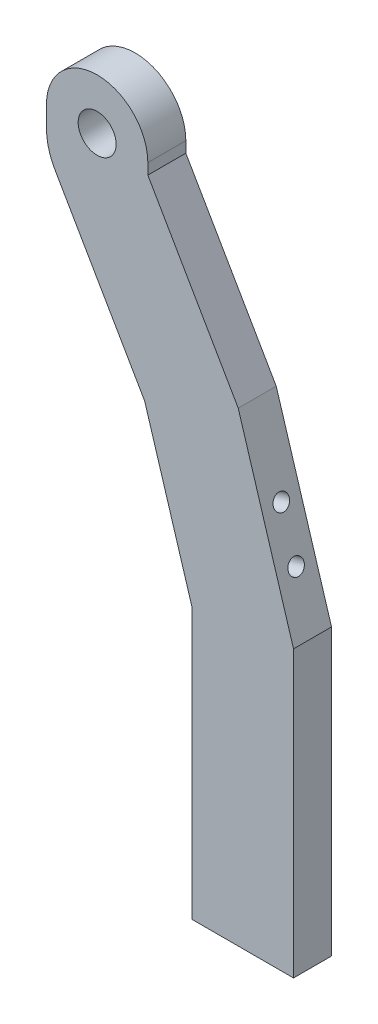
ISO-10303-21;
HEADER;
FILE_DESCRIPTION(('STEP AP214'),'2;1');
FILE_NAME('part.step','',(''),(''),'','','');
FILE_SCHEMA(('AUTOMOTIVE_DESIGN { 1 0 10303 214 1 1 1 1 }'));
ENDSEC;
DATA;
#1=APPLICATION_CONTEXT('core data for automotive mechanical design processes');
#2=APPLICATION_PROTOCOL_DEFINITION('international standard','automotive_design',2000,#1);
#3=PRODUCT_CONTEXT('',#1,'mechanical');
#4=PRODUCT('Part','Part','',(#3));
#5=PRODUCT_RELATED_PRODUCT_CATEGORY('part','',(#4));
#6=PRODUCT_DEFINITION_FORMATION('','',#4);
#7=PRODUCT_DEFINITION_CONTEXT('part definition',#1,'design');
#8=PRODUCT_DEFINITION('design','',#6,#7);
#9=PRODUCT_DEFINITION_SHAPE('','',#8);
#10=(LENGTH_UNIT() NAMED_UNIT(*) SI_UNIT(.MILLI.,.METRE.));
#11=(NAMED_UNIT(*) PLANE_ANGLE_UNIT() SI_UNIT($,.RADIAN.));
#12=(NAMED_UNIT(*) SI_UNIT($,.STERADIAN.) SOLID_ANGLE_UNIT());
#13=UNCERTAINTY_MEASURE_WITH_UNIT(LENGTH_MEASURE(1.E-05),#10,'distance_accuracy_value','');
#14=(GEOMETRIC_REPRESENTATION_CONTEXT(3) GLOBAL_UNCERTAINTY_ASSIGNED_CONTEXT((#13)) GLOBAL_UNIT_ASSIGNED_CONTEXT((#10,
#11,#12)) REPRESENTATION_CONTEXT('',''));
#15=CARTESIAN_POINT('',(0.,0.,0.));
#16=DIRECTION('',(0.,0.,1.));
#17=DIRECTION('',(1.,0.,0.));
#18=AXIS2_PLACEMENT_3D('',#15,#16,#17);
#19=CARTESIAN_POINT('',(-11.8327005271482,49.4894318474889,0.));
#20=DIRECTION('',(0.,0.,1.));
#21=DIRECTION('',(1.,0.,0.));
#22=AXIS2_PLACEMENT_3D('',#19,#20,#21);
#23=PLANE('',#22);
#24=CARTESIAN_POINT('',(-11.8327005271482,49.4894318474889,0.));
#25=DIRECTION('',(0.,0.,1.));
#26=DIRECTION('',(1.,0.,0.));
#27=AXIS2_PLACEMENT_3D('',#24,#25,#26);
#28=CIRCLE('',#27,3.00000000000001);
#29=CARTESIAN_POINT('',(-8.83270052714822,49.4894318474889,0.));
#30=VERTEX_POINT('',#29);
#31=EDGE_CURVE('E203',#30,#30,#28,.T.);
#32=ORIENTED_EDGE('',*,*,#31,.T.);
#33=EDGE_LOOP('',(#32));
#34=FACE_BOUND('',#33,.T.);
#35=DIRECTION('',(-0.499999999999996,0.866025403784441,0.));
#36=VECTOR('',#35,1.);
#37=CARTESIAN_POINT('',(19.1672994728518,7.93945035230217,0.));
#38=LINE('',#37,#36);
#39=CARTESIAN_POINT('',(10.4392225216315,23.0569230841868,0.));
#40=VERTEX_POINT('',#39);
#41=CARTESIAN_POINT('',(-3.83270052714824,47.7766189263868,0.));
#42=VERTEX_POINT('',#41);
#43=EDGE_CURVE('E234',#40,#42,#38,.T.);
#44=ORIENTED_EDGE('',*,*,#43,.F.);
#45=DIRECTION('',(0.292371704722731,-0.956304755963037,0.));
#46=VECTOR('',#45,1.);
#47=CARTESIAN_POINT('',(10.4392225216314,23.0569230841868,0.));
#48=LINE('',#47,#46);
#49=CARTESIAN_POINT('',(19.1672994728518,-5.4913302660442,0.));
#50=VERTEX_POINT('',#49);
#51=EDGE_CURVE('E165',#40,#50,#48,.T.);
#52=ORIENTED_EDGE('',*,*,#51,.T.);
#53=DIRECTION('',(0.,1.,0.));
#54=VECTOR('',#53,1.);
#55=CARTESIAN_POINT('',(19.1672994728518,-56.4913302660442,0.));
#56=LINE('',#55,#54);
#57=CARTESIAN_POINT('',(19.1672994728518,-50.4913302660442,0.));
#58=VERTEX_POINT('',#57);
#59=EDGE_CURVE('E207',#58,#50,#56,.T.);
#60=ORIENTED_EDGE('',*,*,#59,.F.);
#61=DIRECTION('',(1.,0.,0.));
#62=VECTOR('',#61,1.);
#63=CARTESIAN_POINT('',(-11.8327005271482,-50.4913302660442,0.));
#64=LINE('',#63,#62);
#65=CARTESIAN_POINT('',(3.16729947285174,-50.4913302660442,0.));
#66=VERTEX_POINT('',#65);
#67=EDGE_CURVE('E200',#66,#58,#64,.T.);
#68=ORIENTED_EDGE('',*,*,#67,.F.);
#69=DIRECTION('',(0.,-1.,0.));
#70=VECTOR('',#69,1.);
#71=CARTESIAN_POINT('',(3.16729947285175,3.65226327340427,0.));
#72=LINE('',#71,#70);
#73=CARTESIAN_POINT('',(3.16729947285175,-7.88254628763014,0.));
#74=VERTEX_POINT('',#73);
#75=EDGE_CURVE('E215',#74,#66,#72,.T.);
#76=ORIENTED_EDGE('',*,*,#75,.F.);
#77=DIRECTION('',(-0.292371704722731,0.956304755963037,0.));
#78=VECTOR('',#77,1.);
#79=CARTESIAN_POINT('',(-4.32866880533318,16.6356611831456,0.));
#80=LINE('',#79,#78);
#81=CARTESIAN_POINT('',(-4.32866880533337,16.6356611831456,0.));
#82=VERTEX_POINT('',#81);
#83=EDGE_CURVE('E161',#74,#82,#80,.T.);
#84=ORIENTED_EDGE('',*,*,#83,.T.);
#85=DIRECTION('',(0.499999999999995,-0.866025403784441,0.));
#86=VECTOR('',#85,1.);
#87=CARTESIAN_POINT('',(-19.8327005271482,43.4894318474889,0.));
#88=LINE('',#87,#86);
#89=CARTESIAN_POINT('',(-18.4929545649926,41.1689237718002,0.));
#90=VERTEX_POINT('',#89);
#91=EDGE_CURVE('E55',#90,#82,#88,.T.);
#92=ORIENTED_EDGE('',*,*,#91,.F.);
#93=CARTESIAN_POINT('',(-9.83270052714823,46.1689237718001,0.));
#94=DIRECTION('',(0.,0.,1.));
#95=DIRECTION('',(1.,0.,0.));
#96=AXIS2_PLACEMENT_3D('',#93,#94,#95);
#97=CIRCLE('',#96,10.);
#98=CARTESIAN_POINT('',(-19.8327005271482,46.1689237718001,0.));
#99=VERTEX_POINT('',#98);
#100=EDGE_CURVE('E257',#90,#99,#97,.F.);
#101=ORIENTED_EDGE('',*,*,#100,.T.);
#102=DIRECTION('',(0.,-1.,0.));
#103=VECTOR('',#102,1.);
#104=CARTESIAN_POINT('',(-19.8327005271482,49.4894318474889,0.));
#105=LINE('',#104,#103);
#106=CARTESIAN_POINT('',(-19.8327005271482,49.4894318474889,0.));
#107=VERTEX_POINT('',#106);
#108=EDGE_CURVE('E240',#107,#99,#105,.T.);
#109=ORIENTED_EDGE('',*,*,#108,.F.);
#110=CARTESIAN_POINT('',(-11.8327005271482,49.4894318474889,0.));
#111=DIRECTION('',(0.,0.,1.));
#112=DIRECTION('',(1.,0.,0.));
#113=AXIS2_PLACEMENT_3D('',#110,#111,#112);
#114=CIRCLE('',#113,8.);
#115=CARTESIAN_POINT('',(-3.83270052714823,49.4894318474889,0.));
#116=VERTEX_POINT('',#115);
#117=EDGE_CURVE('E238',#116,#107,#114,.T.);
#118=ORIENTED_EDGE('',*,*,#117,.F.);
#119=DIRECTION('',(0.,1.,0.));
#120=VECTOR('',#119,1.);
#121=CARTESIAN_POINT('',(-3.83270052714824,47.7766189263868,0.));
#122=LINE('',#121,#120);
#123=EDGE_CURVE('E236',#42,#116,#122,.T.);
#124=ORIENTED_EDGE('',*,*,#123,.F.);
#125=EDGE_LOOP('',(#44,#52,#60,#68,#76,#84,#92,#101,#109,#118,#124));
#126=FACE_BOUND('',#125,.T.);
#127=ADVANCED_FACE('F40',(#34,#126),#23,.F.);
#128=CARTESIAN_POINT('',(-11.8327005271482,49.4894318474889,6.));
#129=DIRECTION('',(0.,0.,1.));
#130=DIRECTION('',(1.,0.,0.));
#131=AXIS2_PLACEMENT_3D('',#128,#129,#130);
#132=PLANE('',#131);
#133=DIRECTION('',(0.499999999999995,-0.866025403784441,0.));
#134=VECTOR('',#133,1.);
#135=CARTESIAN_POINT('',(-19.8327005271482,43.4894318474889,6.));
#136=LINE('',#135,#134);
#137=CARTESIAN_POINT('',(-18.4929545649926,41.1689237718002,6.));
#138=VERTEX_POINT('',#137);
#139=CARTESIAN_POINT('',(-4.32866880533337,16.6356611831456,6.));
#140=VERTEX_POINT('',#139);
#141=EDGE_CURVE('E225',#138,#140,#136,.T.);
#142=ORIENTED_EDGE('',*,*,#141,.T.);
#143=DIRECTION('',(0.292371704722731,-0.956304755963037,0.));
#144=VECTOR('',#143,1.);
#145=CARTESIAN_POINT('',(-4.32866880533318,16.6356611831456,6.));
#146=LINE('',#145,#144);
#147=CARTESIAN_POINT('',(3.16729947285175,-7.88254628763014,6.));
#148=VERTEX_POINT('',#147);
#149=EDGE_CURVE('E154',#140,#148,#146,.T.);
#150=ORIENTED_EDGE('',*,*,#149,.T.);
#151=DIRECTION('',(0.,-1.,0.));
#152=VECTOR('',#151,1.);
#153=CARTESIAN_POINT('',(3.16729947285175,3.65226327340427,6.));
#154=LINE('',#153,#152);
#155=CARTESIAN_POINT('',(3.16729947285175,-50.4913302660442,6.));
#156=VERTEX_POINT('',#155);
#157=EDGE_CURVE('E227',#148,#156,#154,.T.);
#158=ORIENTED_EDGE('',*,*,#157,.T.);
#159=DIRECTION('',(-1.,0.,0.));
#160=VECTOR('',#159,1.);
#161=CARTESIAN_POINT('',(-11.8327005271482,-50.4913302660442,6.));
#162=LINE('',#161,#160);
#163=CARTESIAN_POINT('',(19.1672994728518,-50.4913302660442,6.));
#164=VERTEX_POINT('',#163);
#165=EDGE_CURVE('E195',#164,#156,#162,.T.);
#166=ORIENTED_EDGE('',*,*,#165,.F.);
#167=DIRECTION('',(0.,1.,0.));
#168=VECTOR('',#167,1.);
#169=CARTESIAN_POINT('',(19.1672994728518,-56.4913302660442,6.));
#170=LINE('',#169,#168);
#171=CARTESIAN_POINT('',(19.1672994728518,-5.4913302660442,6.));
#172=VERTEX_POINT('',#171);
#173=EDGE_CURVE('E210',#164,#172,#170,.T.);
#174=ORIENTED_EDGE('',*,*,#173,.T.);
#175=DIRECTION('',(0.292371704722731,-0.956304755963037,0.));
#176=VECTOR('',#175,1.);
#177=CARTESIAN_POINT('',(10.4392225216314,23.0569230841868,6.));
#178=LINE('',#177,#176);
#179=CARTESIAN_POINT('',(10.4392225216314,23.0569230841868,6.));
#180=VERTEX_POINT('',#179);
#181=EDGE_CURVE('E164',#180,#172,#178,.T.);
#182=ORIENTED_EDGE('',*,*,#181,.F.);
#183=DIRECTION('',(-0.499999999999996,0.866025403784441,0.));
#184=VECTOR('',#183,1.);
#185=CARTESIAN_POINT('',(19.1672994728518,7.93945035230217,6.));
#186=LINE('',#185,#184);
#187=CARTESIAN_POINT('',(-3.83270052714824,47.7766189263868,6.));
#188=VERTEX_POINT('',#187);
#189=EDGE_CURVE('E214',#180,#188,#186,.T.);
#190=ORIENTED_EDGE('',*,*,#189,.T.);
#191=DIRECTION('',(0.,1.,0.));
#192=VECTOR('',#191,1.);
#193=CARTESIAN_POINT('',(-3.83270052714824,47.7766189263868,6.));
#194=LINE('',#193,#192);
#195=CARTESIAN_POINT('',(-3.83270052714823,49.4894318474889,6.));
#196=VERTEX_POINT('',#195);
#197=EDGE_CURVE('E218',#188,#196,#194,.T.);
#198=ORIENTED_EDGE('',*,*,#197,.T.);
#199=CARTESIAN_POINT('',(-11.8327005271482,49.4894318474889,6.));
#200=DIRECTION('',(0.,0.,1.));
#201=DIRECTION('',(1.,0.,0.));
#202=AXIS2_PLACEMENT_3D('',#199,#200,#201);
#203=CIRCLE('',#202,8.);
#204=CARTESIAN_POINT('',(-19.8327005271482,49.4894318474889,6.));
#205=VERTEX_POINT('',#204);
#206=EDGE_CURVE('E220',#196,#205,#203,.T.);
#207=ORIENTED_EDGE('',*,*,#206,.T.);
#208=DIRECTION('',(0.,-1.,0.));
#209=VECTOR('',#208,1.);
#210=CARTESIAN_POINT('',(-19.8327005271482,49.4894318474889,6.));
#211=LINE('',#210,#209);
#212=CARTESIAN_POINT('',(-19.8327005271482,46.1689237718001,6.));
#213=VERTEX_POINT('',#212);
#214=EDGE_CURVE('E222',#205,#213,#211,.T.);
#215=ORIENTED_EDGE('',*,*,#214,.T.);
#216=CARTESIAN_POINT('',(-9.83270052714823,46.1689237718001,6.));
#217=DIRECTION('',(0.,0.,1.));
#218=DIRECTION('',(1.,0.,0.));
#219=AXIS2_PLACEMENT_3D('',#216,#217,#218);
#220=CIRCLE('',#219,10.);
#221=EDGE_CURVE('E11',#213,#138,#220,.T.);
#222=ORIENTED_EDGE('',*,*,#221,.T.);
#223=EDGE_LOOP('',(#142,#150,#158,#166,#174,#182,#190,#198,#207,#215,#222));
#224=FACE_BOUND('',#223,.T.);
#225=CARTESIAN_POINT('',(-11.8327005271482,49.4894318474889,6.));
#226=DIRECTION('',(0.,0.,1.));
#227=DIRECTION('',(1.,0.,0.));
#228=AXIS2_PLACEMENT_3D('',#225,#226,#227);
#229=CIRCLE('',#228,3.00000000000001);
#230=CARTESIAN_POINT('',(-8.83270052714822,49.4894318474889,6.));
#231=VERTEX_POINT('',#230);
#232=EDGE_CURVE('E204',#231,#231,#229,.T.);
#233=ORIENTED_EDGE('',*,*,#232,.F.);
#234=EDGE_LOOP('',(#233));
#235=FACE_BOUND('',#234,.T.);
#236=ADVANCED_FACE('F266',(#224,#235),#132,.T.);
#237=CARTESIAN_POINT('',(19.1672994728518,-56.4913302660442,6.));
#238=DIRECTION('',(-1.,0.,0.));
#239=DIRECTION('',(0.,0.,1.));
#240=AXIS2_PLACEMENT_3D('',#237,#238,#239);
#241=PLANE('',#240);
#242=ORIENTED_EDGE('',*,*,#59,.T.);
#243=DIRECTION('',(0.,0.,1.));
#244=VECTOR('',#243,1.);
#245=CARTESIAN_POINT('',(19.1672994728518,-5.4913302660442,0.));
#246=LINE('',#245,#244);
#247=EDGE_CURVE('E168',#50,#172,#246,.T.);
#248=ORIENTED_EDGE('',*,*,#247,.T.);
#249=ORIENTED_EDGE('',*,*,#173,.F.);
#250=DIRECTION('',(0.,0.,1.));
#251=VECTOR('',#250,1.);
#252=CARTESIAN_POINT('',(19.1672994728518,-50.4913302660442,11.8195488073355));
#253=LINE('',#252,#251);
#254=EDGE_CURVE('E190',#58,#164,#253,.T.);
#255=ORIENTED_EDGE('',*,*,#254,.F.);
#256=EDGE_LOOP('',(#242,#248,#249,#255));
#257=FACE_BOUND('',#256,.T.);
#258=ADVANCED_FACE('F304',(#257),#241,.F.);
#259=CARTESIAN_POINT('',(19.1672994728518,7.93945035230217,6.));
#260=DIRECTION('',(-0.866025403784441,-0.499999999999996,0.));
#261=DIRECTION('',(0.499999999999996,-0.866025403784441,0.));
#262=AXIS2_PLACEMENT_3D('',#259,#260,#261);
#263=PLANE('',#262);
#264=ORIENTED_EDGE('',*,*,#189,.F.);
#265=DIRECTION('',(0.,0.,1.));
#266=VECTOR('',#265,1.);
#267=CARTESIAN_POINT('',(10.4392225216314,23.0569230841868,0.));
#268=LINE('',#267,#266);
#269=EDGE_CURVE('E170',#40,#180,#268,.T.);
#270=ORIENTED_EDGE('',*,*,#269,.F.);
#271=ORIENTED_EDGE('',*,*,#43,.T.);
#272=DIRECTION('',(0.,0.,-1.));
#273=VECTOR('',#272,1.);
#274=CARTESIAN_POINT('',(-3.83270052714824,47.7766189263868,6.));
#275=LINE('',#274,#273);
#276=EDGE_CURVE('E252',#188,#42,#275,.T.);
#277=ORIENTED_EDGE('',*,*,#276,.F.);
#278=EDGE_LOOP('',(#264,#270,#271,#277));
#279=FACE_BOUND('',#278,.T.);
#280=ADVANCED_FACE('F354',(#279),#263,.F.);
#281=CARTESIAN_POINT('',(-3.83270052714824,47.7766189263868,6.));
#282=DIRECTION('',(-1.,0.,0.));
#283=DIRECTION('',(0.,-1.,0.));
#284=AXIS2_PLACEMENT_3D('',#281,#282,#283);
#285=PLANE('',#284);
#286=ORIENTED_EDGE('',*,*,#123,.T.);
#287=DIRECTION('',(0.,0.,-1.));
#288=VECTOR('',#287,1.);
#289=CARTESIAN_POINT('',(-3.83270052714823,49.4894318474889,6.));
#290=LINE('',#289,#288);
#291=EDGE_CURVE('E249',#196,#116,#290,.T.);
#292=ORIENTED_EDGE('',*,*,#291,.F.);
#293=ORIENTED_EDGE('',*,*,#197,.F.);
#294=ORIENTED_EDGE('',*,*,#276,.T.);
#295=EDGE_LOOP('',(#286,#292,#293,#294));
#296=FACE_BOUND('',#295,.T.);
#297=ADVANCED_FACE('F359',(#296),#285,.F.);
#298=CARTESIAN_POINT('',(-11.8327005271482,49.4894318474889,6.));
#299=DIRECTION('',(0.,0.,-1.));
#300=DIRECTION('',(-1.,0.,0.));
#301=AXIS2_PLACEMENT_3D('',#298,#299,#300);
#302=CYLINDRICAL_SURFACE('',#301,8.);
#303=ORIENTED_EDGE('',*,*,#117,.T.);
#304=DIRECTION('',(0.,0.,-1.));
#305=VECTOR('',#304,1.);
#306=CARTESIAN_POINT('',(-19.8327005271482,49.4894318474889,6.));
#307=LINE('',#306,#305);
#308=EDGE_CURVE('E230',#205,#107,#307,.T.);
#309=ORIENTED_EDGE('',*,*,#308,.F.);
#310=ORIENTED_EDGE('',*,*,#206,.F.);
#311=ORIENTED_EDGE('',*,*,#291,.T.);
#312=EDGE_LOOP('',(#303,#309,#310,#311));
#313=FACE_BOUND('',#312,.T.);
#314=ADVANCED_FACE('F362',(#313),#302,.T.);
#315=CARTESIAN_POINT('',(-19.8327005271482,49.4894318474889,6.));
#316=DIRECTION('',(1.,0.,0.));
#317=DIRECTION('',(0.,1.,0.));
#318=AXIS2_PLACEMENT_3D('',#315,#316,#317);
#319=PLANE('',#318);
#320=ORIENTED_EDGE('',*,*,#108,.T.);
#321=DIRECTION('',(0.,0.,-1.));
#322=VECTOR('',#321,1.);
#323=CARTESIAN_POINT('',(-19.8327005271482,46.1689237718001,6.));
#324=LINE('',#323,#322);
#325=EDGE_CURVE('E48',#99,#213,#324,.F.);
#326=ORIENTED_EDGE('',*,*,#325,.T.);
#327=ORIENTED_EDGE('',*,*,#214,.F.);
#328=ORIENTED_EDGE('',*,*,#308,.T.);
#329=EDGE_LOOP('',(#320,#326,#327,#328));
#330=FACE_BOUND('',#329,.T.);
#331=ADVANCED_FACE('F261',(#330),#319,.F.);
#332=CARTESIAN_POINT('',(-19.8327005271482,43.4894318474889,6.));
#333=DIRECTION('',(0.866025403784441,0.499999999999995,0.));
#334=DIRECTION('',(-0.499999999999995,0.866025403784441,0.));
#335=AXIS2_PLACEMENT_3D('',#332,#333,#334);
#336=PLANE('',#335);
#337=ORIENTED_EDGE('',*,*,#91,.T.);
#338=DIRECTION('',(0.,0.,1.));
#339=VECTOR('',#338,1.);
#340=CARTESIAN_POINT('',(-4.32866880533318,16.6356611831456,-25.6384874360318));
#341=LINE('',#340,#339);
#342=EDGE_CURVE('E60',#82,#140,#341,.T.);
#343=ORIENTED_EDGE('',*,*,#342,.T.);
#344=ORIENTED_EDGE('',*,*,#141,.F.);
#345=DIRECTION('',(0.,0.,-1.));
#346=VECTOR('',#345,1.);
#347=CARTESIAN_POINT('',(-18.4929545649926,41.1689237718002,6.));
#348=LINE('',#347,#346);
#349=EDGE_CURVE('E255',#138,#90,#348,.T.);
#350=ORIENTED_EDGE('',*,*,#349,.T.);
#351=EDGE_LOOP('',(#337,#343,#344,#350));
#352=FACE_BOUND('',#351,.T.);
#353=ADVANCED_FACE('F271',(#352),#336,.F.);
#354=CARTESIAN_POINT('',(3.16729947285175,3.65226327340427,6.));
#355=DIRECTION('',(1.,0.,0.));
#356=DIRECTION('',(0.,1.,0.));
#357=AXIS2_PLACEMENT_3D('',#354,#355,#356);
#358=PLANE('',#357);
#359=ORIENTED_EDGE('',*,*,#157,.F.);
#360=DIRECTION('',(0.,0.,1.));
#361=VECTOR('',#360,1.);
#362=CARTESIAN_POINT('',(3.16729947285175,-7.88254628763014,-25.6384874360318));
#363=LINE('',#362,#361);
#364=EDGE_CURVE('E158',#74,#148,#363,.T.);
#365=ORIENTED_EDGE('',*,*,#364,.F.);
#366=ORIENTED_EDGE('',*,*,#75,.T.);
#367=DIRECTION('',(0.,0.,-1.));
#368=VECTOR('',#367,1.);
#369=CARTESIAN_POINT('',(3.16729947285174,-50.4913302660442,11.8195488073355));
#370=LINE('',#369,#368);
#371=EDGE_CURVE('E191',#156,#66,#370,.T.);
#372=ORIENTED_EDGE('',*,*,#371,.F.);
#373=EDGE_LOOP('',(#359,#365,#366,#372));
#374=FACE_BOUND('',#373,.T.);
#375=ADVANCED_FACE('F287',(#374),#358,.F.);
#376=CARTESIAN_POINT('',(-11.8327005271482,49.4894318474889,6.));
#377=DIRECTION('',(0.,0.,-1.));
#378=DIRECTION('',(-1.,0.,0.));
#379=AXIS2_PLACEMENT_3D('',#376,#377,#378);
#380=CYLINDRICAL_SURFACE('',#379,3.00000000000001);
#381=ORIENTED_EDGE('',*,*,#232,.T.);
#382=EDGE_LOOP('',(#381));
#383=FACE_BOUND('',#382,.T.);
#384=ORIENTED_EDGE('',*,*,#31,.F.);
#385=EDGE_LOOP('',(#384));
#386=FACE_BOUND('',#385,.T.);
#387=ADVANCED_FACE('F289',(#383,#386),#380,.F.);
#388=CARTESIAN_POINT('',(-9.83270052714823,46.1689237718001,6.));
#389=DIRECTION('',(0.,0.,-1.));
#390=DIRECTION('',(-1.,0.,0.));
#391=AXIS2_PLACEMENT_3D('',#388,#389,#390);
#392=CYLINDRICAL_SURFACE('',#391,10.);
#393=ORIENTED_EDGE('',*,*,#221,.F.);
#394=ORIENTED_EDGE('',*,*,#325,.F.);
#395=ORIENTED_EDGE('',*,*,#100,.F.);
#396=ORIENTED_EDGE('',*,*,#349,.F.);
#397=EDGE_LOOP('',(#393,#394,#395,#396));
#398=FACE_BOUND('',#397,.T.);
#399=ADVANCED_FACE('F42',(#398),#392,.T.);
#400=CARTESIAN_POINT('',(-39.5429626365712,-50.4913302660442,11.8195488073355));
#401=DIRECTION('',(0.,1.,0.));
#402=DIRECTION('',(0.,0.,1.));
#403=AXIS2_PLACEMENT_3D('',#400,#401,#402);
#404=PLANE('',#403);
#405=CARTESIAN_POINT('',(7.66729947285175,-50.4913302660442,3.));
#406=DIRECTION('',(0.,-1.,0.));
#407=DIRECTION('',(0.,0.,-1.));
#408=AXIS2_PLACEMENT_3D('',#405,#406,#407);
#409=CIRCLE('',#408,1.24999999999999);
#410=CARTESIAN_POINT('',(7.66729947285175,-50.4913302660442,1.75000000000001));
#411=VERTEX_POINT('',#410);
#412=EDGE_CURVE('E172',#411,#411,#409,.T.);
#413=ORIENTED_EDGE('',*,*,#412,.F.);
#414=EDGE_LOOP('',(#413));
#415=FACE_BOUND('',#414,.T.);
#416=CARTESIAN_POINT('',(14.6672994728518,-50.4913302660442,3.));
#417=DIRECTION('',(0.,-1.,0.));
#418=DIRECTION('',(0.,0.,-1.));
#419=AXIS2_PLACEMENT_3D('',#416,#417,#418);
#420=CIRCLE('',#419,1.24999999999999);
#421=CARTESIAN_POINT('',(14.6672994728518,-50.4913302660442,1.75000000000001));
#422=VERTEX_POINT('',#421);
#423=EDGE_CURVE('E182',#422,#422,#420,.T.);
#424=ORIENTED_EDGE('',*,*,#423,.F.);
#425=EDGE_LOOP('',(#424));
#426=FACE_BOUND('',#425,.T.);
#427=ORIENTED_EDGE('',*,*,#254,.T.);
#428=ORIENTED_EDGE('',*,*,#165,.T.);
#429=ORIENTED_EDGE('',*,*,#371,.T.);
#430=ORIENTED_EDGE('',*,*,#67,.T.);
#431=EDGE_LOOP('',(#427,#428,#429,#430));
#432=FACE_BOUND('',#431,.T.);
#433=ADVANCED_FACE('F285',(#415,#426,#432),#404,.F.);
#434=CARTESIAN_POINT('',(14.6672994728518,-42.9913302660442,3.));
#435=DIRECTION('',(0.,-1.,0.));
#436=DIRECTION('',(0.,0.,-1.));
#437=AXIS2_PLACEMENT_3D('',#434,#435,#436);
#438=CONICAL_SURFACE('',#437,1.24999999999999,1.02974425867665);
#439=CARTESIAN_POINT('',(14.6672994728518,-42.2402544922598,3.));
#440=VERTEX_POINT('',#439);
#441=VERTEX_LOOP('',#440);
#442=FACE_BOUND('',#441,.T.);
#443=CARTESIAN_POINT('',(14.6672994728518,-42.9913302660442,3.));
#444=DIRECTION('',(0.,-1.,0.));
#445=DIRECTION('',(0.,0.,-1.));
#446=AXIS2_PLACEMENT_3D('',#443,#444,#445);
#447=CIRCLE('',#446,1.24999999999999);
#448=CARTESIAN_POINT('',(14.6672994728518,-42.9913302660442,1.75000000000001));
#449=VERTEX_POINT('',#448);
#450=EDGE_CURVE('E186',#449,#449,#447,.T.);
#451=ORIENTED_EDGE('',*,*,#450,.T.);
#452=EDGE_LOOP('',(#451));
#453=FACE_BOUND('',#452,.T.);
#454=ADVANCED_FACE('F309',(#442,#453),#438,.F.);
#455=CARTESIAN_POINT('',(14.6672994728518,-50.4913302660442,3.));
#456=DIRECTION('',(0.,-1.,0.));
#457=DIRECTION('',(0.,0.,-1.));
#458=AXIS2_PLACEMENT_3D('',#455,#456,#457);
#459=CYLINDRICAL_SURFACE('',#458,1.24999999999999);
#460=ORIENTED_EDGE('',*,*,#450,.F.);
#461=EDGE_LOOP('',(#460));
#462=FACE_BOUND('',#461,.T.);
#463=ORIENTED_EDGE('',*,*,#423,.T.);
#464=EDGE_LOOP('',(#463));
#465=FACE_BOUND('',#464,.T.);
#466=ADVANCED_FACE('F313',(#462,#465),#459,.F.);
#467=CARTESIAN_POINT('',(7.66729947285175,-42.9913302660442,3.));
#468=DIRECTION('',(0.,-1.,0.));
#469=DIRECTION('',(0.,0.,-1.));
#470=AXIS2_PLACEMENT_3D('',#467,#468,#469);
#471=CONICAL_SURFACE('',#470,1.24999999999999,1.02974425867665);
#472=CARTESIAN_POINT('',(7.66729947285175,-42.2402544922598,3.));
#473=VERTEX_POINT('',#472);
#474=VERTEX_LOOP('',#473);
#475=FACE_BOUND('',#474,.T.);
#476=CARTESIAN_POINT('',(7.66729947285175,-42.9913302660442,3.));
#477=DIRECTION('',(0.,-1.,0.));
#478=DIRECTION('',(0.,0.,-1.));
#479=AXIS2_PLACEMENT_3D('',#476,#477,#478);
#480=CIRCLE('',#479,1.24999999999999);
#481=CARTESIAN_POINT('',(7.66729947285175,-42.9913302660442,1.75000000000001));
#482=VERTEX_POINT('',#481);
#483=EDGE_CURVE('E178',#482,#482,#480,.T.);
#484=ORIENTED_EDGE('',*,*,#483,.T.);
#485=EDGE_LOOP('',(#484));
#486=FACE_BOUND('',#485,.T.);
#487=ADVANCED_FACE('F317',(#475,#486),#471,.F.);
#488=CARTESIAN_POINT('',(7.66729947285175,-50.4913302660442,3.));
#489=DIRECTION('',(0.,-1.,0.));
#490=DIRECTION('',(0.,0.,-1.));
#491=AXIS2_PLACEMENT_3D('',#488,#489,#490);
#492=CYLINDRICAL_SURFACE('',#491,1.24999999999999);
#493=ORIENTED_EDGE('',*,*,#483,.F.);
#494=EDGE_LOOP('',(#493));
#495=FACE_BOUND('',#494,.T.);
#496=ORIENTED_EDGE('',*,*,#412,.T.);
#497=EDGE_LOOP('',(#496));
#498=FACE_BOUND('',#497,.T.);
#499=ADVANCED_FACE('F321',(#495,#498),#492,.F.);
#500=CARTESIAN_POINT('',(10.4392225216314,23.0569230841868,0.));
#501=DIRECTION('',(-0.956304755963037,-0.292371704722731,0.));
#502=DIRECTION('',(0.292371704722731,-0.956304755963037,0.));
#503=AXIS2_PLACEMENT_3D('',#500,#501,#502);
#504=PLANE('',#503);
#505=CARTESIAN_POINT('',(14.2400546830269,10.6249612566673,3.));
#506=DIRECTION('',(0.956304755963037,0.292371704722731,0.));
#507=DIRECTION('',(-0.292371704722731,0.956304755963037,0.));
#508=AXIS2_PLACEMENT_3D('',#505,#506,#507);
#509=CIRCLE('',#508,1.24999999999999);
#510=CARTESIAN_POINT('',(13.8745900521235,11.820342201621,3.));
#511=VERTEX_POINT('',#510);
#512=EDGE_CURVE('E144',#511,#511,#509,.T.);
#513=ORIENTED_EDGE('',*,*,#512,.F.);
#514=EDGE_LOOP('',(#513));
#515=FACE_BOUND('',#514,.T.);
#516=CARTESIAN_POINT('',(16.5790283208087,2.97452320896296,3.));
#517=DIRECTION('',(0.956304755963037,0.292371704722731,0.));
#518=DIRECTION('',(-0.292371704722731,0.956304755963037,0.));
#519=AXIS2_PLACEMENT_3D('',#516,#517,#518);
#520=CIRCLE('',#519,1.24999999999999);
#521=CARTESIAN_POINT('',(16.2135636899053,4.16990415391675,3.));
#522=VERTEX_POINT('',#521);
#523=EDGE_CURVE('E143',#522,#522,#520,.T.);
#524=ORIENTED_EDGE('',*,*,#523,.F.);
#525=EDGE_LOOP('',(#524));
#526=FACE_BOUND('',#525,.T.);
#527=ORIENTED_EDGE('',*,*,#181,.T.);
#528=ORIENTED_EDGE('',*,*,#247,.F.);
#529=ORIENTED_EDGE('',*,*,#51,.F.);
#530=ORIENTED_EDGE('',*,*,#269,.T.);
#531=EDGE_LOOP('',(#527,#528,#529,#530));
#532=FACE_BOUND('',#531,.T.);
#533=ADVANCED_FACE('F325',(#515,#526,#532),#504,.F.);
#534=CARTESIAN_POINT('',(-4.32866880533318,16.6356611831456,-25.6384874360318));
#535=DIRECTION('',(-0.956304755963037,-0.292371704722731,0.));
#536=DIRECTION('',(0.292371704722731,-0.956304755963037,0.));
#537=AXIS2_PLACEMENT_3D('',#534,#535,#536);
#538=PLANE('',#537);
#539=ORIENTED_EDGE('',*,*,#83,.F.);
#540=ORIENTED_EDGE('',*,*,#364,.T.);
#541=ORIENTED_EDGE('',*,*,#149,.F.);
#542=ORIENTED_EDGE('',*,*,#342,.F.);
#543=EDGE_LOOP('',(#539,#540,#541,#542));
#544=FACE_BOUND('',#543,.T.);
#545=ADVANCED_FACE('F279',(#544),#538,.T.);
#546=CARTESIAN_POINT('',(9.40674265108592,0.781735423542483,3.));
#547=DIRECTION('',(0.956304755963037,0.292371704722731,0.));
#548=DIRECTION('',(-0.292371704722731,0.956304755963037,0.));
#549=AXIS2_PLACEMENT_3D('',#546,#547,#548);
#550=CONICAL_SURFACE('',#549,1.24999999999999,1.02974425867665);
#551=CARTESIAN_POINT('',(8.68848531652723,0.562142119185177,3.));
#552=VERTEX_POINT('',#551);
#553=VERTEX_LOOP('',#552);
#554=FACE_BOUND('',#553,.T.);
#555=CARTESIAN_POINT('',(9.40674265108592,0.781735423542483,3.));
#556=DIRECTION('',(0.956304755963037,0.292371704722731,0.));
#557=DIRECTION('',(-0.292371704722731,0.956304755963037,0.));
#558=AXIS2_PLACEMENT_3D('',#555,#556,#557);
#559=CIRCLE('',#558,1.24999999999999);
#560=CARTESIAN_POINT('',(9.04127802018252,1.97711636849627,3.));
#561=VERTEX_POINT('',#560);
#562=EDGE_CURVE('E147',#561,#561,#559,.T.);
#563=ORIENTED_EDGE('',*,*,#562,.T.);
#564=EDGE_LOOP('',(#563));
#565=FACE_BOUND('',#564,.T.);
#566=ADVANCED_FACE('F332',(#554,#565),#550,.F.);
#567=CARTESIAN_POINT('',(16.5790283208087,2.97452320896296,3.));
#568=DIRECTION('',(0.956304755963037,0.292371704722731,0.));
#569=DIRECTION('',(-0.292371704722731,0.956304755963037,0.));
#570=AXIS2_PLACEMENT_3D('',#567,#568,#569);
#571=CYLINDRICAL_SURFACE('',#570,1.24999999999999);
#572=ORIENTED_EDGE('',*,*,#562,.F.);
#573=EDGE_LOOP('',(#572));
#574=FACE_BOUND('',#573,.T.);
#575=ORIENTED_EDGE('',*,*,#523,.T.);
#576=EDGE_LOOP('',(#575));
#577=FACE_BOUND('',#576,.T.);
#578=ADVANCED_FACE('F137',(#574,#577),#571,.F.);
#579=CARTESIAN_POINT('',(7.06776901330409,8.43217347124679,3.));
#580=DIRECTION('',(0.956304755963037,0.292371704722731,0.));
#581=DIRECTION('',(-0.292371704722731,0.956304755963037,0.));
#582=AXIS2_PLACEMENT_3D('',#579,#580,#581);
#583=CONICAL_SURFACE('',#582,1.24999999999999,1.02974425867664);
#584=CARTESIAN_POINT('',(6.34951167874539,8.21258016688948,3.));
#585=VERTEX_POINT('',#584);
#586=VERTEX_LOOP('',#585);
#587=FACE_BOUND('',#586,.T.);
#588=CARTESIAN_POINT('',(7.06776901330409,8.43217347124679,3.));
#589=DIRECTION('',(0.956304755963037,0.292371704722731,0.));
#590=DIRECTION('',(-0.292371704722731,0.956304755963037,0.));
#591=AXIS2_PLACEMENT_3D('',#588,#589,#590);
#592=CIRCLE('',#591,1.24999999999999);
#593=CARTESIAN_POINT('',(6.70230438240068,9.62755441620057,3.));
#594=VERTEX_POINT('',#593);
#595=EDGE_CURVE('E141',#594,#594,#592,.T.);
#596=ORIENTED_EDGE('',*,*,#595,.T.);
#597=EDGE_LOOP('',(#596));
#598=FACE_BOUND('',#597,.T.);
#599=ADVANCED_FACE('F133',(#587,#598),#583,.F.);
#600=CARTESIAN_POINT('',(14.2400546830269,10.6249612566673,3.));
#601=DIRECTION('',(0.956304755963037,0.292371704722731,0.));
#602=DIRECTION('',(-0.292371704722731,0.956304755963037,0.));
#603=AXIS2_PLACEMENT_3D('',#600,#601,#602);
#604=CYLINDRICAL_SURFACE('',#603,1.24999999999999);
#605=ORIENTED_EDGE('',*,*,#595,.F.);
#606=EDGE_LOOP('',(#605));
#607=FACE_BOUND('',#606,.T.);
#608=ORIENTED_EDGE('',*,*,#512,.T.);
#609=EDGE_LOOP('',(#608));
#610=FACE_BOUND('',#609,.T.);
#611=ADVANCED_FACE('F136',(#607,#610),#604,.F.);
#612=CLOSED_SHELL('',(#127,#236,#258,#280,#297,#314,#331,#353,#375,#387,#399,#433,#454,#466,
#487,#499,#533,#545,#566,#578,#599,#611));
#613=MANIFOLD_SOLID_BREP('B2',#612);
#614=ADVANCED_BREP_SHAPE_REPRESENTATION('',(#18,#613),#14);
#615=SHAPE_DEFINITION_REPRESENTATION(#9,#614);
ENDSEC;
END-ISO-10303-21;
